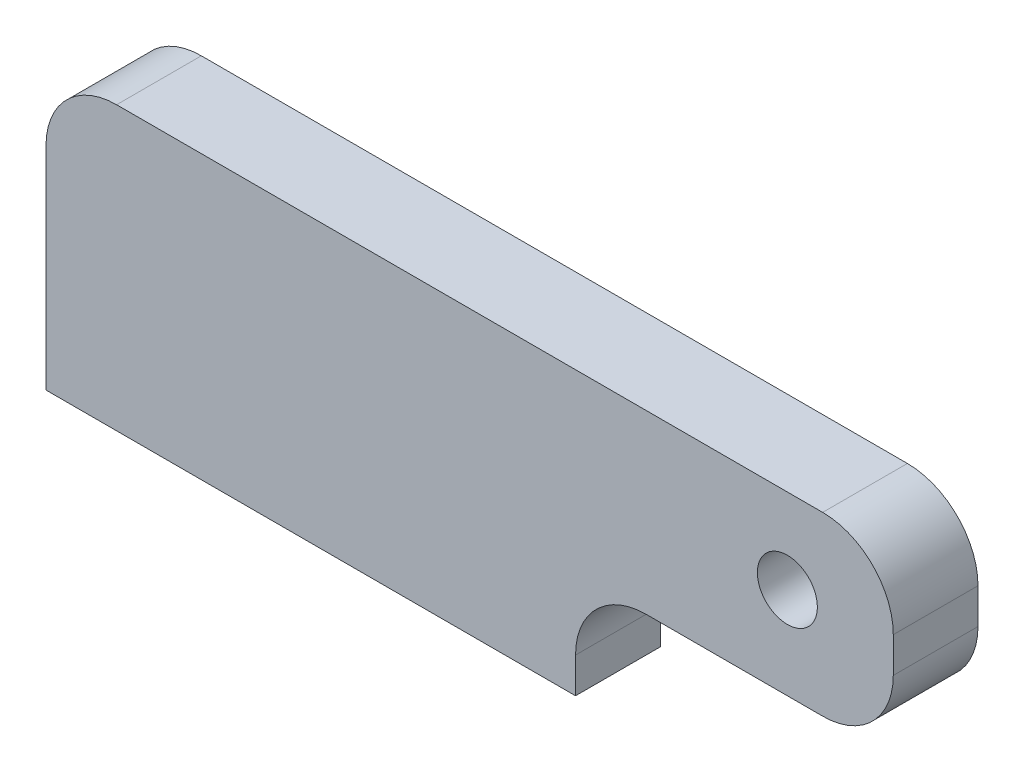
ISO-10303-21;
HEADER;
FILE_DESCRIPTION(('STEP AP214'),'2;1');
FILE_NAME('part.step','',(''),(''),'','','');
FILE_SCHEMA(('AUTOMOTIVE_DESIGN { 1 0 10303 214 1 1 1 1 }'));
ENDSEC;
DATA;
#1=APPLICATION_CONTEXT('core data for automotive mechanical design processes');
#2=APPLICATION_PROTOCOL_DEFINITION('international standard','automotive_design',2000,#1);
#3=PRODUCT_CONTEXT('',#1,'mechanical');
#4=PRODUCT('Part','Part','',(#3));
#5=PRODUCT_RELATED_PRODUCT_CATEGORY('part','',(#4));
#6=PRODUCT_DEFINITION_FORMATION('','',#4);
#7=PRODUCT_DEFINITION_CONTEXT('part definition',#1,'design');
#8=PRODUCT_DEFINITION('design','',#6,#7);
#9=PRODUCT_DEFINITION_SHAPE('','',#8);
#10=(LENGTH_UNIT() NAMED_UNIT(*) SI_UNIT(.MILLI.,.METRE.));
#11=(NAMED_UNIT(*) PLANE_ANGLE_UNIT() SI_UNIT($,.RADIAN.));
#12=(NAMED_UNIT(*) SI_UNIT($,.STERADIAN.) SOLID_ANGLE_UNIT());
#13=UNCERTAINTY_MEASURE_WITH_UNIT(LENGTH_MEASURE(1.E-05),#10,'distance_accuracy_value','');
#14=(GEOMETRIC_REPRESENTATION_CONTEXT(3) GLOBAL_UNCERTAINTY_ASSIGNED_CONTEXT((#13)) GLOBAL_UNIT_ASSIGNED_CONTEXT((#10,
#11,#12)) REPRESENTATION_CONTEXT('',''));
#15=CARTESIAN_POINT('',(0.,0.,0.));
#16=DIRECTION('',(0.,0.,1.));
#17=DIRECTION('',(1.,0.,0.));
#18=AXIS2_PLACEMENT_3D('',#15,#16,#17);
#19=CARTESIAN_POINT('',(0.,0.,-6.));
#20=DIRECTION('',(0.,0.,-1.));
#21=DIRECTION('',(-1.,0.,0.));
#22=AXIS2_PLACEMENT_3D('',#19,#20,#21);
#23=PLANE('',#22);
#24=DIRECTION('',(0.,-1.,0.));
#25=VECTOR('',#24,1.);
#26=CARTESIAN_POINT('',(0.,0.,-6.));
#27=LINE('',#26,#25);
#28=CARTESIAN_POINT('',(0.,30.,-6.));
#29=VERTEX_POINT('',#28);
#30=CARTESIAN_POINT('',(0.,0.,-6.));
#31=VERTEX_POINT('',#30);
#32=EDGE_CURVE('E157',#29,#31,#27,.T.);
#33=ORIENTED_EDGE('',*,*,#32,.F.);
#34=CARTESIAN_POINT('',(10.,30.,-6.));
#35=DIRECTION('',(0.,0.,-1.));
#36=DIRECTION('',(-1.,0.,0.));
#37=AXIS2_PLACEMENT_3D('',#34,#35,#36);
#38=CIRCLE('',#37,10.);
#39=CARTESIAN_POINT('',(10.,40.,-6.));
#40=VERTEX_POINT('',#39);
#41=EDGE_CURVE('E199',#29,#40,#38,.T.);
#42=ORIENTED_EDGE('',*,*,#41,.T.);
#43=DIRECTION('',(-1.,0.,0.));
#44=VECTOR('',#43,1.);
#45=CARTESIAN_POINT('',(0.,40.,-6.));
#46=LINE('',#45,#44);
#47=CARTESIAN_POINT('',(110.,40.,-6.));
#48=VERTEX_POINT('',#47);
#49=EDGE_CURVE('E161',#48,#40,#46,.T.);
#50=ORIENTED_EDGE('',*,*,#49,.F.);
#51=CARTESIAN_POINT('',(110.,30.,-6.));
#52=DIRECTION('',(0.,0.,-1.));
#53=DIRECTION('',(-1.,0.,0.));
#54=AXIS2_PLACEMENT_3D('',#51,#52,#53);
#55=CIRCLE('',#54,10.);
#56=CARTESIAN_POINT('',(120.,30.,-6.));
#57=VERTEX_POINT('',#56);
#58=EDGE_CURVE('E195',#48,#57,#55,.T.);
#59=ORIENTED_EDGE('',*,*,#58,.T.);
#60=DIRECTION('',(0.,1.,0.));
#61=VECTOR('',#60,1.);
#62=CARTESIAN_POINT('',(120.,40.,-6.));
#63=LINE('',#62,#61);
#64=CARTESIAN_POINT('',(120.,25.,-6.));
#65=VERTEX_POINT('',#64);
#66=EDGE_CURVE('E183',#65,#57,#63,.T.);
#67=ORIENTED_EDGE('',*,*,#66,.F.);
#68=CARTESIAN_POINT('',(110.,25.,-6.));
#69=DIRECTION('',(0.,0.,-1.));
#70=DIRECTION('',(-1.,0.,0.));
#71=AXIS2_PLACEMENT_3D('',#68,#69,#70);
#72=CIRCLE('',#71,10.);
#73=CARTESIAN_POINT('',(110.,15.,-6.));
#74=VERTEX_POINT('',#73);
#75=EDGE_CURVE('E197',#65,#74,#72,.T.);
#76=ORIENTED_EDGE('',*,*,#75,.T.);
#77=DIRECTION('',(1.,0.,0.));
#78=VECTOR('',#77,1.);
#79=CARTESIAN_POINT('',(75.,15.,-6.));
#80=LINE('',#79,#78);
#81=CARTESIAN_POINT('',(85.,15.,-6.));
#82=VERTEX_POINT('',#81);
#83=EDGE_CURVE('E180',#82,#74,#80,.T.);
#84=ORIENTED_EDGE('',*,*,#83,.F.);
#85=CARTESIAN_POINT('',(85.,5.,-6.));
#86=DIRECTION('',(0.,0.,-1.));
#87=DIRECTION('',(-1.,0.,0.));
#88=AXIS2_PLACEMENT_3D('',#85,#86,#87);
#89=CIRCLE('',#88,10.);
#90=CARTESIAN_POINT('',(75.,5.,-6.));
#91=VERTEX_POINT('',#90);
#92=EDGE_CURVE('E60',#82,#91,#89,.F.);
#93=ORIENTED_EDGE('',*,*,#92,.T.);
#94=DIRECTION('',(0.,1.,0.));
#95=VECTOR('',#94,1.);
#96=CARTESIAN_POINT('',(75.,0.,-6.));
#97=LINE('',#96,#95);
#98=CARTESIAN_POINT('',(75.,0.,-6.));
#99=VERTEX_POINT('',#98);
#100=EDGE_CURVE('E177',#99,#91,#97,.T.);
#101=ORIENTED_EDGE('',*,*,#100,.F.);
#102=DIRECTION('',(1.,0.,0.));
#103=VECTOR('',#102,1.);
#104=CARTESIAN_POINT('',(0.,0.,-6.));
#105=LINE('',#104,#103);
#106=EDGE_CURVE('E175',#31,#99,#105,.T.);
#107=ORIENTED_EDGE('',*,*,#106,.F.);
#108=EDGE_LOOP('',(#33,#42,#50,#59,#67,#76,#84,#93,#101,#107));
#109=FACE_BOUND('',#108,.T.);
#110=CARTESIAN_POINT('',(105.,28.,-6.));
#111=DIRECTION('',(0.,0.,1.));
#112=DIRECTION('',(1.,0.,0.));
#113=AXIS2_PLACEMENT_3D('',#110,#111,#112);
#114=CIRCLE('',#113,4.25);
#115=CARTESIAN_POINT('',(109.25,28.,-6.));
#116=VERTEX_POINT('',#115);
#117=EDGE_CURVE('E151',#116,#116,#114,.T.);
#118=ORIENTED_EDGE('',*,*,#117,.T.);
#119=EDGE_LOOP('',(#118));
#120=FACE_BOUND('',#119,.T.);
#121=ADVANCED_FACE('F52',(#109,#120),#23,.T.);
#122=CARTESIAN_POINT('',(0.,0.,6.));
#123=DIRECTION('',(1.,0.,0.));
#124=DIRECTION('',(0.,0.,-1.));
#125=AXIS2_PLACEMENT_3D('',#122,#123,#124);
#126=PLANE('',#125);
#127=DIRECTION('',(0.,-1.,0.));
#128=VECTOR('',#127,1.);
#129=CARTESIAN_POINT('',(0.,0.,6.));
#130=LINE('',#129,#128);
#131=CARTESIAN_POINT('',(0.,30.,6.));
#132=VERTEX_POINT('',#131);
#133=CARTESIAN_POINT('',(0.,0.,6.));
#134=VERTEX_POINT('',#133);
#135=EDGE_CURVE('E158',#132,#134,#130,.T.);
#136=ORIENTED_EDGE('',*,*,#135,.F.);
#137=DIRECTION('',(0.,0.,-1.));
#138=VECTOR('',#137,1.);
#139=CARTESIAN_POINT('',(0.,30.,6.));
#140=LINE('',#139,#138);
#141=EDGE_CURVE('E192',#132,#29,#140,.T.);
#142=ORIENTED_EDGE('',*,*,#141,.T.);
#143=ORIENTED_EDGE('',*,*,#32,.T.);
#144=DIRECTION('',(0.,0.,-1.));
#145=VECTOR('',#144,1.);
#146=CARTESIAN_POINT('',(0.,0.,6.));
#147=LINE('',#146,#145);
#148=EDGE_CURVE('E189',#134,#31,#147,.T.);
#149=ORIENTED_EDGE('',*,*,#148,.F.);
#150=EDGE_LOOP('',(#136,#142,#143,#149));
#151=FACE_BOUND('',#150,.T.);
#152=ADVANCED_FACE('F260',(#151),#126,.F.);
#153=CARTESIAN_POINT('',(0.,0.,6.));
#154=DIRECTION('',(0.,1.,0.));
#155=DIRECTION('',(0.,0.,1.));
#156=AXIS2_PLACEMENT_3D('',#153,#154,#155);
#157=PLANE('',#156);
#158=CARTESIAN_POINT('',(10.,0.,0.));
#159=DIRECTION('',(0.,-1.,0.));
#160=DIRECTION('',(0.,0.,-1.));
#161=AXIS2_PLACEMENT_3D('',#158,#159,#160);
#162=CIRCLE('',#161,2.49999999999999);
#163=CARTESIAN_POINT('',(10.,0.,-2.49999999999999));
#164=VERTEX_POINT('',#163);
#165=EDGE_CURVE('E145',#164,#164,#162,.T.);
#166=ORIENTED_EDGE('',*,*,#165,.F.);
#167=EDGE_LOOP('',(#166));
#168=FACE_BOUND('',#167,.T.);
#169=CARTESIAN_POINT('',(65.,0.,0.));
#170=DIRECTION('',(0.,-1.,0.));
#171=DIRECTION('',(0.,0.,-1.));
#172=AXIS2_PLACEMENT_3D('',#169,#170,#171);
#173=CIRCLE('',#172,2.49999999999999);
#174=CARTESIAN_POINT('',(65.,0.,-2.49999999999998));
#175=VERTEX_POINT('',#174);
#176=EDGE_CURVE('E144',#175,#175,#173,.T.);
#177=ORIENTED_EDGE('',*,*,#176,.F.);
#178=EDGE_LOOP('',(#177));
#179=FACE_BOUND('',#178,.T.);
#180=ORIENTED_EDGE('',*,*,#106,.T.);
#181=DIRECTION('',(0.,0.,-1.));
#182=VECTOR('',#181,1.);
#183=CARTESIAN_POINT('',(75.,0.,6.));
#184=LINE('',#183,#182);
#185=CARTESIAN_POINT('',(75.,0.,6.));
#186=VERTEX_POINT('',#185);
#187=EDGE_CURVE('E173',#186,#99,#184,.T.);
#188=ORIENTED_EDGE('',*,*,#187,.F.);
#189=DIRECTION('',(1.,0.,0.));
#190=VECTOR('',#189,1.);
#191=CARTESIAN_POINT('',(0.,0.,6.));
#192=LINE('',#191,#190);
#193=EDGE_CURVE('E160',#134,#186,#192,.T.);
#194=ORIENTED_EDGE('',*,*,#193,.F.);
#195=ORIENTED_EDGE('',*,*,#148,.T.);
#196=EDGE_LOOP('',(#180,#188,#194,#195));
#197=FACE_BOUND('',#196,.T.);
#198=ADVANCED_FACE('F264',(#168,#179,#197),#157,.F.);
#199=CARTESIAN_POINT('',(75.,0.,6.));
#200=DIRECTION('',(-1.,0.,0.));
#201=DIRECTION('',(0.,0.,1.));
#202=AXIS2_PLACEMENT_3D('',#199,#200,#201);
#203=PLANE('',#202);
#204=ORIENTED_EDGE('',*,*,#100,.T.);
#205=DIRECTION('',(0.,0.,-1.));
#206=VECTOR('',#205,1.);
#207=CARTESIAN_POINT('',(75.,5.,6.));
#208=LINE('',#207,#206);
#209=CARTESIAN_POINT('',(75.,5.,6.));
#210=VERTEX_POINT('',#209);
#211=EDGE_CURVE('E216',#91,#210,#208,.F.);
#212=ORIENTED_EDGE('',*,*,#211,.T.);
#213=DIRECTION('',(0.,1.,0.));
#214=VECTOR('',#213,1.);
#215=CARTESIAN_POINT('',(75.,0.,6.));
#216=LINE('',#215,#214);
#217=EDGE_CURVE('E163',#186,#210,#216,.T.);
#218=ORIENTED_EDGE('',*,*,#217,.F.);
#219=ORIENTED_EDGE('',*,*,#187,.T.);
#220=EDGE_LOOP('',(#204,#212,#218,#219));
#221=FACE_BOUND('',#220,.T.);
#222=ADVANCED_FACE('F231',(#221),#203,.F.);
#223=CARTESIAN_POINT('',(75.,15.,6.));
#224=DIRECTION('',(0.,1.,0.));
#225=DIRECTION('',(0.,0.,1.));
#226=AXIS2_PLACEMENT_3D('',#223,#224,#225);
#227=PLANE('',#226);
#228=DIRECTION('',(1.,0.,0.));
#229=VECTOR('',#228,1.);
#230=CARTESIAN_POINT('',(75.,15.,6.));
#231=LINE('',#230,#229);
#232=CARTESIAN_POINT('',(85.,15.,6.));
#233=VERTEX_POINT('',#232);
#234=CARTESIAN_POINT('',(110.,15.,6.));
#235=VERTEX_POINT('',#234);
#236=EDGE_CURVE('E166',#233,#235,#231,.T.);
#237=ORIENTED_EDGE('',*,*,#236,.F.);
#238=DIRECTION('',(0.,0.,-1.));
#239=VECTOR('',#238,1.);
#240=CARTESIAN_POINT('',(85.,15.,-6.));
#241=LINE('',#240,#239);
#242=EDGE_CURVE('E213',#233,#82,#241,.T.);
#243=ORIENTED_EDGE('',*,*,#242,.T.);
#244=ORIENTED_EDGE('',*,*,#83,.T.);
#245=DIRECTION('',(0.,0.,-1.));
#246=VECTOR('',#245,1.);
#247=CARTESIAN_POINT('',(110.,15.,6.));
#248=LINE('',#247,#246);
#249=EDGE_CURVE('E211',#74,#235,#248,.F.);
#250=ORIENTED_EDGE('',*,*,#249,.T.);
#251=EDGE_LOOP('',(#237,#243,#244,#250));
#252=FACE_BOUND('',#251,.T.);
#253=ADVANCED_FACE('F239',(#252),#227,.F.);
#254=CARTESIAN_POINT('',(120.,40.,6.));
#255=DIRECTION('',(-1.,0.,0.));
#256=DIRECTION('',(0.,0.,1.));
#257=AXIS2_PLACEMENT_3D('',#254,#255,#256);
#258=PLANE('',#257);
#259=DIRECTION('',(0.,1.,0.));
#260=VECTOR('',#259,1.);
#261=CARTESIAN_POINT('',(120.,40.,6.));
#262=LINE('',#261,#260);
#263=CARTESIAN_POINT('',(120.,25.,6.));
#264=VERTEX_POINT('',#263);
#265=CARTESIAN_POINT('',(120.,30.,6.));
#266=VERTEX_POINT('',#265);
#267=EDGE_CURVE('E168',#264,#266,#262,.T.);
#268=ORIENTED_EDGE('',*,*,#267,.F.);
#269=DIRECTION('',(0.,0.,-1.));
#270=VECTOR('',#269,1.);
#271=CARTESIAN_POINT('',(120.,25.,6.));
#272=LINE('',#271,#270);
#273=EDGE_CURVE('E219',#264,#65,#272,.T.);
#274=ORIENTED_EDGE('',*,*,#273,.T.);
#275=ORIENTED_EDGE('',*,*,#66,.T.);
#276=DIRECTION('',(0.,0.,-1.));
#277=VECTOR('',#276,1.);
#278=CARTESIAN_POINT('',(120.,30.,6.));
#279=LINE('',#278,#277);
#280=EDGE_CURVE('E67',#57,#266,#279,.F.);
#281=ORIENTED_EDGE('',*,*,#280,.T.);
#282=EDGE_LOOP('',(#268,#274,#275,#281));
#283=FACE_BOUND('',#282,.T.);
#284=ADVANCED_FACE('F245',(#283),#258,.F.);
#285=CARTESIAN_POINT('',(0.,40.,6.));
#286=DIRECTION('',(0.,-1.,0.));
#287=DIRECTION('',(0.,0.,-1.));
#288=AXIS2_PLACEMENT_3D('',#285,#286,#287);
#289=PLANE('',#288);
#290=ORIENTED_EDGE('',*,*,#49,.T.);
#291=DIRECTION('',(0.,0.,-1.));
#292=VECTOR('',#291,1.);
#293=CARTESIAN_POINT('',(10.,40.,6.));
#294=LINE('',#293,#292);
#295=CARTESIAN_POINT('',(10.,40.,6.));
#296=VERTEX_POINT('',#295);
#297=EDGE_CURVE('E204',#40,#296,#294,.F.);
#298=ORIENTED_EDGE('',*,*,#297,.T.);
#299=DIRECTION('',(-1.,0.,0.));
#300=VECTOR('',#299,1.);
#301=CARTESIAN_POINT('',(0.,40.,6.));
#302=LINE('',#301,#300);
#303=CARTESIAN_POINT('',(110.,40.,6.));
#304=VERTEX_POINT('',#303);
#305=EDGE_CURVE('E170',#304,#296,#302,.T.);
#306=ORIENTED_EDGE('',*,*,#305,.F.);
#307=DIRECTION('',(0.,0.,-1.));
#308=VECTOR('',#307,1.);
#309=CARTESIAN_POINT('',(110.,40.,6.));
#310=LINE('',#309,#308);
#311=EDGE_CURVE('E201',#304,#48,#310,.T.);
#312=ORIENTED_EDGE('',*,*,#311,.T.);
#313=EDGE_LOOP('',(#290,#298,#306,#312));
#314=FACE_BOUND('',#313,.T.);
#315=ADVANCED_FACE('F252',(#314),#289,.F.);
#316=CARTESIAN_POINT('',(0.,0.,6.));
#317=DIRECTION('',(0.,0.,-1.));
#318=DIRECTION('',(-1.,0.,0.));
#319=AXIS2_PLACEMENT_3D('',#316,#317,#318);
#320=PLANE('',#319);
#321=CARTESIAN_POINT('',(105.,28.,6.));
#322=DIRECTION('',(0.,0.,1.));
#323=DIRECTION('',(1.,0.,0.));
#324=AXIS2_PLACEMENT_3D('',#321,#322,#323);
#325=CIRCLE('',#324,4.25);
#326=CARTESIAN_POINT('',(109.25,28.,6.));
#327=VERTEX_POINT('',#326);
#328=EDGE_CURVE('E421',#327,#327,#325,.T.);
#329=ORIENTED_EDGE('',*,*,#328,.F.);
#330=EDGE_LOOP('',(#329));
#331=FACE_BOUND('',#330,.T.);
#332=ORIENTED_EDGE('',*,*,#305,.T.);
#333=CARTESIAN_POINT('',(10.,30.,6.));
#334=DIRECTION('',(0.,0.,-1.));
#335=DIRECTION('',(-1.,0.,0.));
#336=AXIS2_PLACEMENT_3D('',#333,#334,#335);
#337=CIRCLE('',#336,10.);
#338=EDGE_CURVE('E209',#296,#132,#337,.F.);
#339=ORIENTED_EDGE('',*,*,#338,.T.);
#340=ORIENTED_EDGE('',*,*,#135,.T.);
#341=ORIENTED_EDGE('',*,*,#193,.T.);
#342=ORIENTED_EDGE('',*,*,#217,.T.);
#343=CARTESIAN_POINT('',(85.,5.,6.));
#344=DIRECTION('',(0.,0.,-1.));
#345=DIRECTION('',(-1.,0.,0.));
#346=AXIS2_PLACEMENT_3D('',#343,#344,#345);
#347=CIRCLE('',#346,10.);
#348=EDGE_CURVE('E13',#210,#233,#347,.T.);
#349=ORIENTED_EDGE('',*,*,#348,.T.);
#350=ORIENTED_EDGE('',*,*,#236,.T.);
#351=CARTESIAN_POINT('',(110.,25.,6.));
#352=DIRECTION('',(0.,0.,-1.));
#353=DIRECTION('',(-1.,0.,0.));
#354=AXIS2_PLACEMENT_3D('',#351,#352,#353);
#355=CIRCLE('',#354,10.);
#356=EDGE_CURVE('E74',#235,#264,#355,.F.);
#357=ORIENTED_EDGE('',*,*,#356,.T.);
#358=ORIENTED_EDGE('',*,*,#267,.T.);
#359=CARTESIAN_POINT('',(110.,30.,6.));
#360=DIRECTION('',(0.,0.,-1.));
#361=DIRECTION('',(-1.,0.,0.));
#362=AXIS2_PLACEMENT_3D('',#359,#360,#361);
#363=CIRCLE('',#362,10.);
#364=EDGE_CURVE('E206',#266,#304,#363,.F.);
#365=ORIENTED_EDGE('',*,*,#364,.T.);
#366=EDGE_LOOP('',(#332,#339,#340,#341,#342,#349,#350,#357,#358,#365));
#367=FACE_BOUND('',#366,.T.);
#368=ADVANCED_FACE('F237',(#331,#367),#320,.F.);
#369=CARTESIAN_POINT('',(65.,18.,0.));
#370=DIRECTION('',(0.,-1.,0.));
#371=DIRECTION('',(0.,0.,-1.));
#372=AXIS2_PLACEMENT_3D('',#369,#370,#371);
#373=CONICAL_SURFACE('',#372,2.5,1.02974425867665);
#374=CARTESIAN_POINT('',(65.,19.5021515475689,0.));
#375=VERTEX_POINT('',#374);
#376=VERTEX_LOOP('',#375);
#377=FACE_BOUND('',#376,.T.);
#378=CARTESIAN_POINT('',(65.,18.,0.));
#379=DIRECTION('',(0.,-1.,0.));
#380=DIRECTION('',(0.,0.,-1.));
#381=AXIS2_PLACEMENT_3D('',#378,#379,#380);
#382=CIRCLE('',#381,2.5);
#383=CARTESIAN_POINT('',(65.,18.,-2.5));
#384=VERTEX_POINT('',#383);
#385=EDGE_CURVE('E148',#384,#384,#382,.T.);
#386=ORIENTED_EDGE('',*,*,#385,.T.);
#387=EDGE_LOOP('',(#386));
#388=FACE_BOUND('',#387,.T.);
#389=ADVANCED_FACE('F307',(#377,#388),#373,.F.);
#390=CARTESIAN_POINT('',(65.,0.,0.));
#391=DIRECTION('',(0.,-1.,0.));
#392=DIRECTION('',(0.,0.,-1.));
#393=AXIS2_PLACEMENT_3D('',#390,#391,#392);
#394=CYLINDRICAL_SURFACE('',#393,2.5);
#395=ORIENTED_EDGE('',*,*,#385,.F.);
#396=EDGE_LOOP('',(#395));
#397=FACE_BOUND('',#396,.T.);
#398=ORIENTED_EDGE('',*,*,#176,.T.);
#399=EDGE_LOOP('',(#398));
#400=FACE_BOUND('',#399,.T.);
#401=ADVANCED_FACE('F138',(#397,#400),#394,.F.);
#402=CARTESIAN_POINT('',(10.,18.,0.));
#403=DIRECTION('',(0.,-1.,0.));
#404=DIRECTION('',(0.,0.,-1.));
#405=AXIS2_PLACEMENT_3D('',#402,#403,#404);
#406=CONICAL_SURFACE('',#405,2.5,1.02974425867665);
#407=CARTESIAN_POINT('',(9.99999999999999,19.5021515475689,0.));
#408=VERTEX_POINT('',#407);
#409=VERTEX_LOOP('',#408);
#410=FACE_BOUND('',#409,.T.);
#411=CARTESIAN_POINT('',(10.,18.,0.));
#412=DIRECTION('',(0.,-1.,0.));
#413=DIRECTION('',(0.,0.,-1.));
#414=AXIS2_PLACEMENT_3D('',#411,#412,#413);
#415=CIRCLE('',#414,2.5);
#416=CARTESIAN_POINT('',(10.,18.,-2.49999999999999));
#417=VERTEX_POINT('',#416);
#418=EDGE_CURVE('E142',#417,#417,#415,.T.);
#419=ORIENTED_EDGE('',*,*,#418,.T.);
#420=EDGE_LOOP('',(#419));
#421=FACE_BOUND('',#420,.T.);
#422=ADVANCED_FACE('F134',(#410,#421),#406,.F.);
#423=CARTESIAN_POINT('',(10.,0.,0.));
#424=DIRECTION('',(0.,-1.,0.));
#425=DIRECTION('',(0.,0.,-1.));
#426=AXIS2_PLACEMENT_3D('',#423,#424,#425);
#427=CYLINDRICAL_SURFACE('',#426,2.49999999999999);
#428=ORIENTED_EDGE('',*,*,#418,.F.);
#429=EDGE_LOOP('',(#428));
#430=FACE_BOUND('',#429,.T.);
#431=ORIENTED_EDGE('',*,*,#165,.T.);
#432=EDGE_LOOP('',(#431));
#433=FACE_BOUND('',#432,.T.);
#434=ADVANCED_FACE('F137',(#430,#433),#427,.F.);
#435=CARTESIAN_POINT('',(10.,30.,6.));
#436=DIRECTION('',(0.,0.,-1.));
#437=DIRECTION('',(-1.,0.,0.));
#438=AXIS2_PLACEMENT_3D('',#435,#436,#437);
#439=CYLINDRICAL_SURFACE('',#438,10.);
#440=ORIENTED_EDGE('',*,*,#338,.F.);
#441=ORIENTED_EDGE('',*,*,#297,.F.);
#442=ORIENTED_EDGE('',*,*,#41,.F.);
#443=ORIENTED_EDGE('',*,*,#141,.F.);
#444=EDGE_LOOP('',(#440,#441,#442,#443));
#445=FACE_BOUND('',#444,.T.);
#446=ADVANCED_FACE('F258',(#445),#439,.T.);
#447=CARTESIAN_POINT('',(85.,5.,6.));
#448=DIRECTION('',(0.,0.,1.));
#449=DIRECTION('',(1.,0.,0.));
#450=AXIS2_PLACEMENT_3D('',#447,#448,#449);
#451=CYLINDRICAL_SURFACE('',#450,10.);
#452=ORIENTED_EDGE('',*,*,#348,.F.);
#453=ORIENTED_EDGE('',*,*,#211,.F.);
#454=ORIENTED_EDGE('',*,*,#92,.F.);
#455=ORIENTED_EDGE('',*,*,#242,.F.);
#456=EDGE_LOOP('',(#452,#453,#454,#455));
#457=FACE_BOUND('',#456,.T.);
#458=ADVANCED_FACE('F235',(#457),#451,.F.);
#459=CARTESIAN_POINT('',(110.,25.,6.));
#460=DIRECTION('',(0.,0.,-1.));
#461=DIRECTION('',(-1.,0.,0.));
#462=AXIS2_PLACEMENT_3D('',#459,#460,#461);
#463=CYLINDRICAL_SURFACE('',#462,10.);
#464=ORIENTED_EDGE('',*,*,#356,.F.);
#465=ORIENTED_EDGE('',*,*,#249,.F.);
#466=ORIENTED_EDGE('',*,*,#75,.F.);
#467=ORIENTED_EDGE('',*,*,#273,.F.);
#468=EDGE_LOOP('',(#464,#465,#466,#467));
#469=FACE_BOUND('',#468,.T.);
#470=ADVANCED_FACE('F242',(#469),#463,.T.);
#471=CARTESIAN_POINT('',(110.,30.,6.));
#472=DIRECTION('',(0.,0.,-1.));
#473=DIRECTION('',(-1.,0.,0.));
#474=AXIS2_PLACEMENT_3D('',#471,#472,#473);
#475=CYLINDRICAL_SURFACE('',#474,10.);
#476=ORIENTED_EDGE('',*,*,#364,.F.);
#477=ORIENTED_EDGE('',*,*,#280,.F.);
#478=ORIENTED_EDGE('',*,*,#58,.F.);
#479=ORIENTED_EDGE('',*,*,#311,.F.);
#480=EDGE_LOOP('',(#476,#477,#478,#479));
#481=FACE_BOUND('',#480,.T.);
#482=ADVANCED_FACE('F54',(#481),#475,.T.);
#483=CARTESIAN_POINT('',(105.,28.,6.));
#484=DIRECTION('',(0.,0.,1.));
#485=DIRECTION('',(1.,0.,0.));
#486=AXIS2_PLACEMENT_3D('',#483,#484,#485);
#487=CYLINDRICAL_SURFACE('',#486,4.25);
#488=ORIENTED_EDGE('',*,*,#117,.F.);
#489=EDGE_LOOP('',(#488));
#490=FACE_BOUND('',#489,.T.);
#491=ORIENTED_EDGE('',*,*,#328,.T.);
#492=EDGE_LOOP('',(#491));
#493=FACE_BOUND('',#492,.T.);
#494=ADVANCED_FACE('F356',(#490,#493),#487,.F.);
#495=CLOSED_SHELL('',(#121,#152,#198,#222,#253,#284,#315,#368,#389,#401,#422,#434,#446,#458,
#470,#482,#494));
#496=MANIFOLD_SOLID_BREP('B2',#495);
#497=ADVANCED_BREP_SHAPE_REPRESENTATION('',(#18,#496),#14);
#498=SHAPE_DEFINITION_REPRESENTATION(#9,#497);
ENDSEC;
END-ISO-10303-21;
